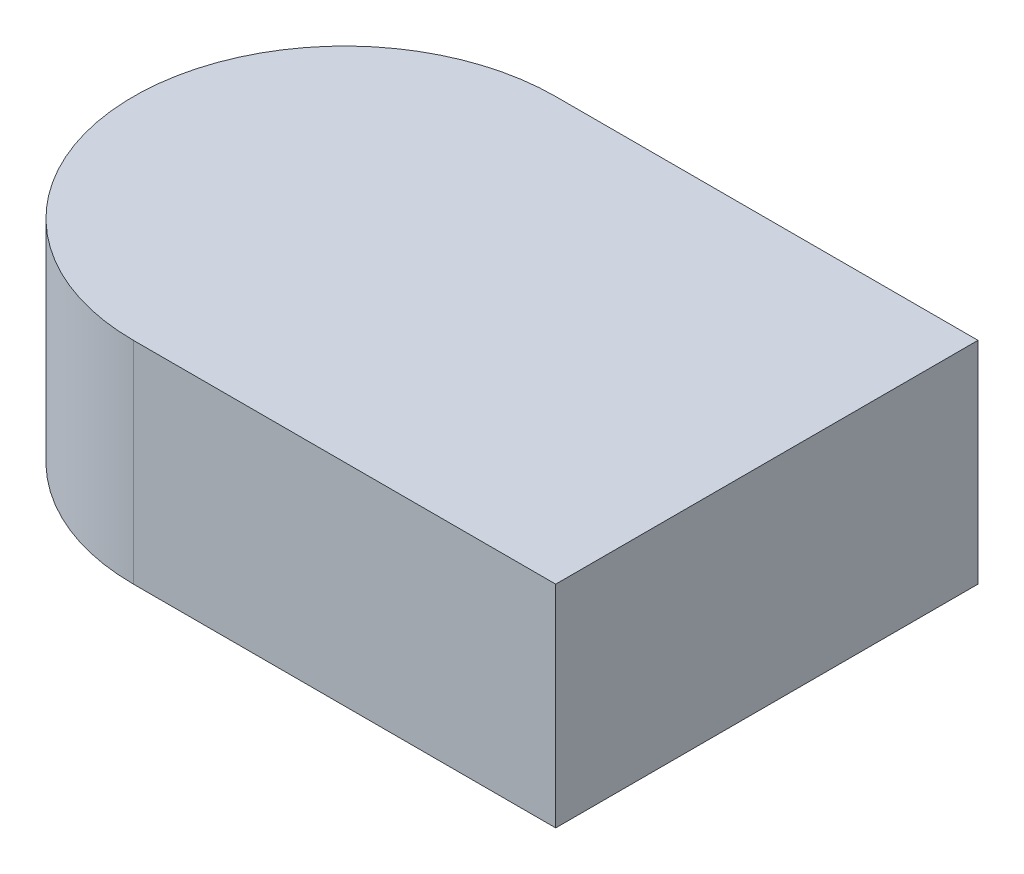
ISO-10303-21;
HEADER;
FILE_DESCRIPTION(('STEP AP214'),'2;1');
FILE_NAME('part.step','',(''),(''),'','','');
FILE_SCHEMA(('AUTOMOTIVE_DESIGN { 1 0 10303 214 1 1 1 1 }'));
ENDSEC;
DATA;
#1=APPLICATION_CONTEXT('core data for automotive mechanical design processes');
#2=APPLICATION_PROTOCOL_DEFINITION('international standard','automotive_design',2000,#1);
#3=PRODUCT_CONTEXT('',#1,'mechanical');
#4=PRODUCT('Part','Part','',(#3));
#5=PRODUCT_RELATED_PRODUCT_CATEGORY('part','',(#4));
#6=PRODUCT_DEFINITION_FORMATION('','',#4);
#7=PRODUCT_DEFINITION_CONTEXT('part definition',#1,'design');
#8=PRODUCT_DEFINITION('design','',#6,#7);
#9=PRODUCT_DEFINITION_SHAPE('','',#8);
#10=(LENGTH_UNIT() NAMED_UNIT(*) SI_UNIT(.MILLI.,.METRE.));
#11=(NAMED_UNIT(*) PLANE_ANGLE_UNIT() SI_UNIT($,.RADIAN.));
#12=(NAMED_UNIT(*) SI_UNIT($,.STERADIAN.) SOLID_ANGLE_UNIT());
#13=UNCERTAINTY_MEASURE_WITH_UNIT(LENGTH_MEASURE(1.E-05),#10,'distance_accuracy_value','');
#14=(GEOMETRIC_REPRESENTATION_CONTEXT(3) GLOBAL_UNCERTAINTY_ASSIGNED_CONTEXT((#13)) GLOBAL_UNIT_ASSIGNED_CONTEXT((#10,
#11,#12)) REPRESENTATION_CONTEXT('',''));
#15=CARTESIAN_POINT('',(0.,0.,0.));
#16=DIRECTION('',(0.,0.,1.));
#17=DIRECTION('',(1.,0.,0.));
#18=AXIS2_PLACEMENT_3D('',#15,#16,#17);
#19=CARTESIAN_POINT('',(0.,0.,0.));
#20=DIRECTION('',(0.,1.,0.));
#21=DIRECTION('',(1.,0.,0.));
#22=AXIS2_PLACEMENT_3D('',#19,#20,#21);
#23=PLANE('',#22);
#24=DIRECTION('',(0.,0.,-1.));
#25=VECTOR('',#24,1.);
#26=CARTESIAN_POINT('',(1.25,0.,-0.5));
#27=LINE('',#26,#25);
#28=CARTESIAN_POINT('',(1.25,0.,-0.5));
#29=VERTEX_POINT('',#28);
#30=CARTESIAN_POINT('',(1.25,0.,-0.7));
#31=VERTEX_POINT('',#30);
#32=EDGE_CURVE('E11',#29,#31,#27,.T.);
#33=ORIENTED_EDGE('',*,*,#32,.F.);
#34=DIRECTION('',(1.,0.,0.));
#35=VECTOR('',#34,1.);
#36=CARTESIAN_POINT('',(1.05,0.,-0.5));
#37=LINE('',#36,#35);
#38=CARTESIAN_POINT('',(1.05,0.,-0.5));
#39=VERTEX_POINT('',#38);
#40=EDGE_CURVE('E25',#39,#29,#37,.T.);
#41=ORIENTED_EDGE('',*,*,#40,.F.);
#42=CARTESIAN_POINT('',(1.05,0.,-0.6));
#43=DIRECTION('',(0.,1.,0.));
#44=DIRECTION('',(0.,0.,-1.));
#45=AXIS2_PLACEMENT_3D('',#42,#43,#44);
#46=CIRCLE('',#45,0.1);
#47=CARTESIAN_POINT('',(1.05,0.,-0.7));
#48=VERTEX_POINT('',#47);
#49=EDGE_CURVE('E73',#48,#39,#46,.T.);
#50=ORIENTED_EDGE('',*,*,#49,.F.);
#51=DIRECTION('',(-1.,0.,0.));
#52=VECTOR('',#51,1.);
#53=CARTESIAN_POINT('',(1.25,0.,-0.7));
#54=LINE('',#53,#52);
#55=EDGE_CURVE('E99',#31,#48,#54,.T.);
#56=ORIENTED_EDGE('',*,*,#55,.F.);
#57=EDGE_LOOP('',(#33,#41,#50,#56));
#58=FACE_BOUND('',#57,.T.);
#59=ADVANCED_FACE('F17',(#58),#23,.F.);
#60=CARTESIAN_POINT('',(1.25,0.,-0.7));
#61=DIRECTION('',(0.,0.,-1.));
#62=DIRECTION('',(-1.,0.,0.));
#63=AXIS2_PLACEMENT_3D('',#60,#61,#62);
#64=PLANE('',#63);
#65=DIRECTION('',(0.,1.,0.));
#66=VECTOR('',#65,1.);
#67=CARTESIAN_POINT('',(1.05,0.,-0.7));
#68=LINE('',#67,#66);
#69=CARTESIAN_POINT('',(1.05,0.1,-0.7));
#70=VERTEX_POINT('',#69);
#71=EDGE_CURVE('E95',#48,#70,#68,.T.);
#72=ORIENTED_EDGE('',*,*,#71,.T.);
#73=DIRECTION('',(-1.,0.,0.));
#74=VECTOR('',#73,1.);
#75=CARTESIAN_POINT('',(1.25,0.1,-0.7));
#76=LINE('',#75,#74);
#77=CARTESIAN_POINT('',(1.25,0.1,-0.7));
#78=VERTEX_POINT('',#77);
#79=EDGE_CURVE('E68',#78,#70,#76,.T.);
#80=ORIENTED_EDGE('',*,*,#79,.F.);
#81=DIRECTION('',(0.,1.,0.));
#82=VECTOR('',#81,1.);
#83=CARTESIAN_POINT('',(1.25,0.,-0.7));
#84=LINE('',#83,#82);
#85=EDGE_CURVE('E87',#31,#78,#84,.T.);
#86=ORIENTED_EDGE('',*,*,#85,.F.);
#87=ORIENTED_EDGE('',*,*,#55,.T.);
#88=EDGE_LOOP('',(#72,#80,#86,#87));
#89=FACE_BOUND('',#88,.T.);
#90=ADVANCED_FACE('F113',(#89),#64,.T.);
#91=CARTESIAN_POINT('',(1.25,0.,-0.5));
#92=DIRECTION('',(1.,0.,0.));
#93=DIRECTION('',(0.,0.,-1.));
#94=AXIS2_PLACEMENT_3D('',#91,#92,#93);
#95=PLANE('',#94);
#96=ORIENTED_EDGE('',*,*,#85,.T.);
#97=DIRECTION('',(0.,0.,-1.));
#98=VECTOR('',#97,1.);
#99=CARTESIAN_POINT('',(1.25,0.1,-0.5));
#100=LINE('',#99,#98);
#101=CARTESIAN_POINT('',(1.25,0.1,-0.5));
#102=VERTEX_POINT('',#101);
#103=EDGE_CURVE('E83',#102,#78,#100,.T.);
#104=ORIENTED_EDGE('',*,*,#103,.F.);
#105=DIRECTION('',(0.,1.,0.));
#106=VECTOR('',#105,1.);
#107=CARTESIAN_POINT('',(1.25,0.,-0.5));
#108=LINE('',#107,#106);
#109=EDGE_CURVE('E60',#29,#102,#108,.T.);
#110=ORIENTED_EDGE('',*,*,#109,.F.);
#111=ORIENTED_EDGE('',*,*,#32,.T.);
#112=EDGE_LOOP('',(#96,#104,#110,#111));
#113=FACE_BOUND('',#112,.T.);
#114=ADVANCED_FACE('F119',(#113),#95,.T.);
#115=CARTESIAN_POINT('',(1.05,0.,-0.5));
#116=DIRECTION('',(0.,0.,1.));
#117=DIRECTION('',(1.,0.,0.));
#118=AXIS2_PLACEMENT_3D('',#115,#116,#117);
#119=PLANE('',#118);
#120=ORIENTED_EDGE('',*,*,#109,.T.);
#121=DIRECTION('',(1.,0.,0.));
#122=VECTOR('',#121,1.);
#123=CARTESIAN_POINT('',(1.05,0.1,-0.5));
#124=LINE('',#123,#122);
#125=CARTESIAN_POINT('',(1.05,0.1,-0.5));
#126=VERTEX_POINT('',#125);
#127=EDGE_CURVE('E54',#126,#102,#124,.T.);
#128=ORIENTED_EDGE('',*,*,#127,.F.);
#129=DIRECTION('',(0.,1.,0.));
#130=VECTOR('',#129,1.);
#131=CARTESIAN_POINT('',(1.05,0.,-0.5));
#132=LINE('',#131,#130);
#133=EDGE_CURVE('E58',#39,#126,#132,.T.);
#134=ORIENTED_EDGE('',*,*,#133,.F.);
#135=ORIENTED_EDGE('',*,*,#40,.T.);
#136=EDGE_LOOP('',(#120,#128,#134,#135));
#137=FACE_BOUND('',#136,.T.);
#138=ADVANCED_FACE('F56',(#137),#119,.T.);
#139=CARTESIAN_POINT('',(1.05,0.,-0.6));
#140=DIRECTION('',(0.,1.,0.));
#141=DIRECTION('',(1.,0.,0.));
#142=AXIS2_PLACEMENT_3D('',#139,#140,#141);
#143=CYLINDRICAL_SURFACE('',#142,0.1);
#144=ORIENTED_EDGE('',*,*,#133,.T.);
#145=CARTESIAN_POINT('',(1.05,0.1,-0.6));
#146=DIRECTION('',(0.,1.,0.));
#147=DIRECTION('',(0.,0.,-1.));
#148=AXIS2_PLACEMENT_3D('',#145,#146,#147);
#149=CIRCLE('',#148,0.1);
#150=EDGE_CURVE('E66',#70,#126,#149,.T.);
#151=ORIENTED_EDGE('',*,*,#150,.F.);
#152=ORIENTED_EDGE('',*,*,#71,.F.);
#153=ORIENTED_EDGE('',*,*,#49,.T.);
#154=EDGE_LOOP('',(#144,#151,#152,#153));
#155=FACE_BOUND('',#154,.T.);
#156=ADVANCED_FACE('F72',(#155),#143,.T.);
#157=CARTESIAN_POINT('',(0.,0.1,0.));
#158=DIRECTION('',(0.,1.,0.));
#159=DIRECTION('',(1.,0.,0.));
#160=AXIS2_PLACEMENT_3D('',#157,#158,#159);
#161=PLANE('',#160);
#162=ORIENTED_EDGE('',*,*,#150,.T.);
#163=ORIENTED_EDGE('',*,*,#127,.T.);
#164=ORIENTED_EDGE('',*,*,#103,.T.);
#165=ORIENTED_EDGE('',*,*,#79,.T.);
#166=EDGE_LOOP('',(#162,#163,#164,#165));
#167=FACE_BOUND('',#166,.T.);
#168=ADVANCED_FACE('F67',(#167),#161,.T.);
#169=CLOSED_SHELL('',(#59,#90,#114,#138,#156,#168));
#170=MANIFOLD_SOLID_BREP('B1',#169);
#171=ADVANCED_BREP_SHAPE_REPRESENTATION('',(#18,#170),#14);
#172=SHAPE_DEFINITION_REPRESENTATION(#9,#171);
ENDSEC;
END-ISO-10303-21;
